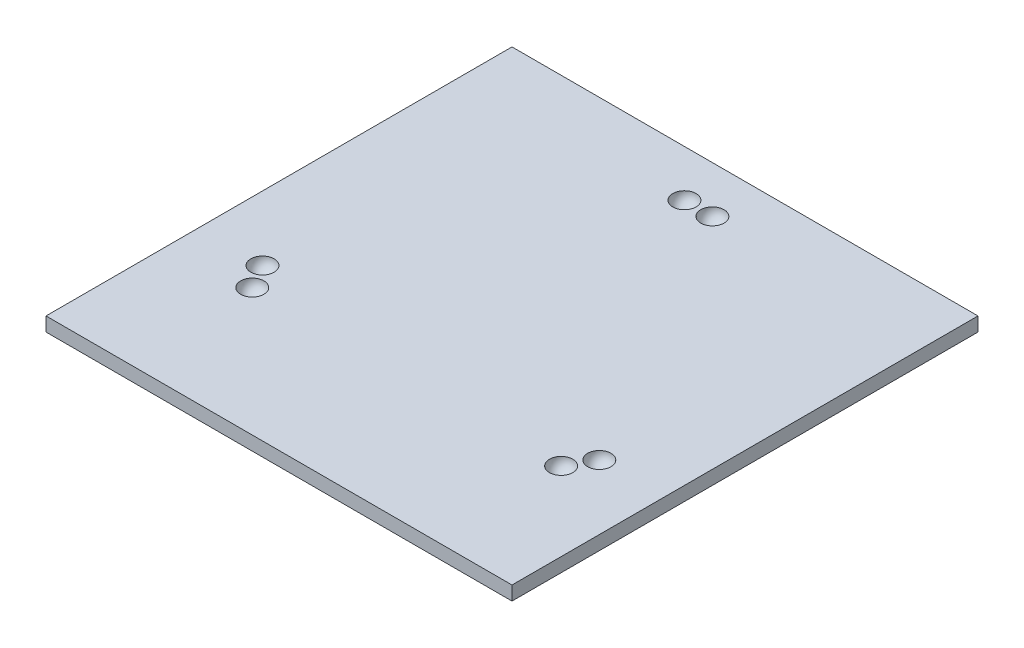
ISO-10303-21;
HEADER;
FILE_DESCRIPTION(('STEP AP214'),'2;1');
FILE_NAME('part.step','',(''),(''),'','','');
FILE_SCHEMA(('AUTOMOTIVE_DESIGN { 1 0 10303 214 1 1 1 1 }'));
ENDSEC;
DATA;
#1=APPLICATION_CONTEXT('core data for automotive mechanical design processes');
#2=APPLICATION_PROTOCOL_DEFINITION('international standard','automotive_design',2000,#1);
#3=PRODUCT_CONTEXT('',#1,'mechanical');
#4=PRODUCT('Part','Part','',(#3));
#5=PRODUCT_RELATED_PRODUCT_CATEGORY('part','',(#4));
#6=PRODUCT_DEFINITION_FORMATION('','',#4);
#7=PRODUCT_DEFINITION_CONTEXT('part definition',#1,'design');
#8=PRODUCT_DEFINITION('design','',#6,#7);
#9=PRODUCT_DEFINITION_SHAPE('','',#8);
#10=(LENGTH_UNIT() NAMED_UNIT(*) SI_UNIT(.MILLI.,.METRE.));
#11=(NAMED_UNIT(*) PLANE_ANGLE_UNIT() SI_UNIT($,.RADIAN.));
#12=(NAMED_UNIT(*) SI_UNIT($,.STERADIAN.) SOLID_ANGLE_UNIT());
#13=UNCERTAINTY_MEASURE_WITH_UNIT(LENGTH_MEASURE(1.E-05),#10,'distance_accuracy_value','');
#14=(GEOMETRIC_REPRESENTATION_CONTEXT(3) GLOBAL_UNCERTAINTY_ASSIGNED_CONTEXT((#13)) GLOBAL_UNIT_ASSIGNED_CONTEXT((#10,
#11,#12)) REPRESENTATION_CONTEXT('',''));
#15=CARTESIAN_POINT('',(0.,0.,0.));
#16=DIRECTION('',(0.,0.,1.));
#17=DIRECTION('',(1.,0.,0.));
#18=AXIS2_PLACEMENT_3D('',#15,#16,#17);
#19=CARTESIAN_POINT('',(100.,6.,100.));
#20=DIRECTION('',(-1.,0.,0.));
#21=DIRECTION('',(0.,0.,1.));
#22=AXIS2_PLACEMENT_3D('',#19,#20,#21);
#23=PLANE('',#22);
#24=DIRECTION('',(0.,0.,-1.));
#25=VECTOR('',#24,1.);
#26=CARTESIAN_POINT('',(100.,0.,100.));
#27=LINE('',#26,#25);
#28=CARTESIAN_POINT('',(100.,0.,100.));
#29=VERTEX_POINT('',#28);
#30=CARTESIAN_POINT('',(100.,0.,-100.));
#31=VERTEX_POINT('',#30);
#32=EDGE_CURVE('E95',#29,#31,#27,.T.);
#33=ORIENTED_EDGE('',*,*,#32,.T.);
#34=DIRECTION('',(0.,-1.,0.));
#35=VECTOR('',#34,1.);
#36=CARTESIAN_POINT('',(100.,6.,-100.));
#37=LINE('',#36,#35);
#38=CARTESIAN_POINT('',(100.,6.,-100.));
#39=VERTEX_POINT('',#38);
#40=EDGE_CURVE('E11',#39,#31,#37,.T.);
#41=ORIENTED_EDGE('',*,*,#40,.F.);
#42=DIRECTION('',(0.,0.,-1.));
#43=VECTOR('',#42,1.);
#44=CARTESIAN_POINT('',(100.,6.,100.));
#45=LINE('',#44,#43);
#46=CARTESIAN_POINT('',(100.,6.,100.));
#47=VERTEX_POINT('',#46);
#48=EDGE_CURVE('E83',#47,#39,#45,.T.);
#49=ORIENTED_EDGE('',*,*,#48,.F.);
#50=DIRECTION('',(0.,-1.,0.));
#51=VECTOR('',#50,1.);
#52=CARTESIAN_POINT('',(100.,6.,100.));
#53=LINE('',#52,#51);
#54=EDGE_CURVE('E91',#47,#29,#53,.T.);
#55=ORIENTED_EDGE('',*,*,#54,.T.);
#56=EDGE_LOOP('',(#33,#41,#49,#55));
#57=FACE_BOUND('',#56,.T.);
#58=ADVANCED_FACE('F32',(#57),#23,.F.);
#59=CARTESIAN_POINT('',(-100.,6.,-100.));
#60=DIRECTION('',(0.,0.,1.));
#61=DIRECTION('',(1.,0.,0.));
#62=AXIS2_PLACEMENT_3D('',#59,#60,#61);
#63=PLANE('',#62);
#64=DIRECTION('',(-1.,0.,0.));
#65=VECTOR('',#64,1.);
#66=CARTESIAN_POINT('',(-100.,0.,-100.));
#67=LINE('',#66,#65);
#68=CARTESIAN_POINT('',(-100.,0.,-100.));
#69=VERTEX_POINT('',#68);
#70=EDGE_CURVE('E87',#31,#69,#67,.T.);
#71=ORIENTED_EDGE('',*,*,#70,.T.);
#72=DIRECTION('',(0.,-1.,0.));
#73=VECTOR('',#72,1.);
#74=CARTESIAN_POINT('',(-100.,6.,-100.));
#75=LINE('',#74,#73);
#76=CARTESIAN_POINT('',(-100.,6.,-100.));
#77=VERTEX_POINT('',#76);
#78=EDGE_CURVE('E40',#77,#69,#75,.T.);
#79=ORIENTED_EDGE('',*,*,#78,.F.);
#80=DIRECTION('',(-1.,0.,0.));
#81=VECTOR('',#80,1.);
#82=CARTESIAN_POINT('',(-100.,6.,-100.));
#83=LINE('',#82,#81);
#84=EDGE_CURVE('E78',#39,#77,#83,.T.);
#85=ORIENTED_EDGE('',*,*,#84,.F.);
#86=ORIENTED_EDGE('',*,*,#40,.T.);
#87=EDGE_LOOP('',(#71,#79,#85,#86));
#88=FACE_BOUND('',#87,.T.);
#89=ADVANCED_FACE('F86',(#88),#63,.F.);
#90=CARTESIAN_POINT('',(-100.,6.,100.));
#91=DIRECTION('',(1.,0.,0.));
#92=DIRECTION('',(0.,0.,-1.));
#93=AXIS2_PLACEMENT_3D('',#90,#91,#92);
#94=PLANE('',#93);
#95=DIRECTION('',(0.,0.,1.));
#96=VECTOR('',#95,1.);
#97=CARTESIAN_POINT('',(-100.,0.,100.));
#98=LINE('',#97,#96);
#99=CARTESIAN_POINT('',(-100.,0.,100.));
#100=VERTEX_POINT('',#99);
#101=EDGE_CURVE('E65',#69,#100,#98,.T.);
#102=ORIENTED_EDGE('',*,*,#101,.T.);
#103=DIRECTION('',(0.,-1.,0.));
#104=VECTOR('',#103,1.);
#105=CARTESIAN_POINT('',(-100.,6.,100.));
#106=LINE('',#105,#104);
#107=CARTESIAN_POINT('',(-100.,6.,100.));
#108=VERTEX_POINT('',#107);
#109=EDGE_CURVE('E88',#108,#100,#106,.T.);
#110=ORIENTED_EDGE('',*,*,#109,.F.);
#111=DIRECTION('',(0.,0.,1.));
#112=VECTOR('',#111,1.);
#113=CARTESIAN_POINT('',(-100.,6.,100.));
#114=LINE('',#113,#112);
#115=EDGE_CURVE('E81',#77,#108,#114,.T.);
#116=ORIENTED_EDGE('',*,*,#115,.F.);
#117=ORIENTED_EDGE('',*,*,#78,.T.);
#118=EDGE_LOOP('',(#102,#110,#116,#117));
#119=FACE_BOUND('',#118,.T.);
#120=ADVANCED_FACE('F89',(#119),#94,.F.);
#121=CARTESIAN_POINT('',(-100.,6.,100.));
#122=DIRECTION('',(0.,0.,-1.));
#123=DIRECTION('',(-1.,0.,0.));
#124=AXIS2_PLACEMENT_3D('',#121,#122,#123);
#125=PLANE('',#124);
#126=DIRECTION('',(1.,0.,0.));
#127=VECTOR('',#126,1.);
#128=CARTESIAN_POINT('',(-100.,0.,100.));
#129=LINE('',#128,#127);
#130=EDGE_CURVE('E71',#100,#29,#129,.T.);
#131=ORIENTED_EDGE('',*,*,#130,.T.);
#132=ORIENTED_EDGE('',*,*,#54,.F.);
#133=DIRECTION('',(1.,0.,0.));
#134=VECTOR('',#133,1.);
#135=CARTESIAN_POINT('',(-100.,6.,100.));
#136=LINE('',#135,#134);
#137=EDGE_CURVE('E48',#108,#47,#136,.T.);
#138=ORIENTED_EDGE('',*,*,#137,.F.);
#139=ORIENTED_EDGE('',*,*,#109,.T.);
#140=EDGE_LOOP('',(#131,#132,#138,#139));
#141=FACE_BOUND('',#140,.T.);
#142=ADVANCED_FACE('F103',(#141),#125,.F.);
#143=CARTESIAN_POINT('',(0.,6.,0.));
#144=DIRECTION('',(0.,-1.,0.));
#145=DIRECTION('',(0.,0.,-1.));
#146=AXIS2_PLACEMENT_3D('',#143,#144,#145);
#147=PLANE('',#146);
#148=CARTESIAN_POINT('',(66.2820323027549,6.,45.196152422707));
#149=DIRECTION('',(0.,1.,0.));
#150=DIRECTION('',(0.,0.,-1.));
#151=AXIS2_PLACEMENT_3D('',#148,#149,#150);
#152=CIRCLE('',#151,5.);
#153=CARTESIAN_POINT('',(66.2820323027549,6.,40.196152422707));
#154=VERTEX_POINT('',#153);
#155=EDGE_CURVE('E123',#154,#154,#152,.T.);
#156=ORIENTED_EDGE('',*,*,#155,.F.);
#157=EDGE_LOOP('',(#156));
#158=FACE_BOUND('',#157,.T.);
#159=CARTESIAN_POINT('',(72.2820323027555,6.,34.8038475772927));
#160=DIRECTION('',(0.,-1.,0.));
#161=DIRECTION('',(-0.866025403784436,0.,0.500000000000004));
#162=AXIS2_PLACEMENT_3D('',#159,#160,#161);
#163=CIRCLE('',#162,5.);
#164=CARTESIAN_POINT('',(67.9519052838333,6.,37.3038475772927));
#165=VERTEX_POINT('',#164);
#166=EDGE_CURVE('E120',#165,#165,#163,.T.);
#167=ORIENTED_EDGE('',*,*,#166,.T.);
#168=EDGE_LOOP('',(#167));
#169=FACE_BOUND('',#168,.T.);
#170=CARTESIAN_POINT('',(6.,6.,-80.));
#171=DIRECTION('',(0.,-1.,0.));
#172=DIRECTION('',(1.,0.,0.));
#173=AXIS2_PLACEMENT_3D('',#170,#171,#172);
#174=CIRCLE('',#173,5.);
#175=CARTESIAN_POINT('',(11.,6.,-80.));
#176=VERTEX_POINT('',#175);
#177=EDGE_CURVE('E117',#176,#176,#174,.T.);
#178=ORIENTED_EDGE('',*,*,#177,.T.);
#179=EDGE_LOOP('',(#178));
#180=FACE_BOUND('',#179,.T.);
#181=CARTESIAN_POINT('',(-72.2820323027555,6.,34.8038475772927));
#182=DIRECTION('',(0.,1.,0.));
#183=DIRECTION('',(0.866025403784436,0.,0.500000000000004));
#184=AXIS2_PLACEMENT_3D('',#181,#182,#183);
#185=CIRCLE('',#184,5.);
#186=CARTESIAN_POINT('',(-67.9519052838333,6.,37.3038475772927));
#187=VERTEX_POINT('',#186);
#188=EDGE_CURVE('E114',#187,#187,#185,.T.);
#189=ORIENTED_EDGE('',*,*,#188,.F.);
#190=EDGE_LOOP('',(#189));
#191=FACE_BOUND('',#190,.T.);
#192=CARTESIAN_POINT('',(-66.2820323027549,6.,45.196152422707));
#193=DIRECTION('',(0.,-1.,0.));
#194=DIRECTION('',(0.,0.,-1.));
#195=AXIS2_PLACEMENT_3D('',#192,#193,#194);
#196=CIRCLE('',#195,5.);
#197=CARTESIAN_POINT('',(-66.2820323027549,6.,40.196152422707));
#198=VERTEX_POINT('',#197);
#199=EDGE_CURVE('E111',#198,#198,#196,.T.);
#200=ORIENTED_EDGE('',*,*,#199,.T.);
#201=EDGE_LOOP('',(#200));
#202=FACE_BOUND('',#201,.T.);
#203=CARTESIAN_POINT('',(-6.,6.,-80.));
#204=DIRECTION('',(0.,1.,0.));
#205=DIRECTION('',(-1.,0.,0.));
#206=AXIS2_PLACEMENT_3D('',#203,#204,#205);
#207=CIRCLE('',#206,5.);
#208=CARTESIAN_POINT('',(-11.,6.,-80.));
#209=VERTEX_POINT('',#208);
#210=EDGE_CURVE('E98',#209,#209,#207,.T.);
#211=ORIENTED_EDGE('',*,*,#210,.F.);
#212=EDGE_LOOP('',(#211));
#213=FACE_BOUND('',#212,.T.);
#214=ORIENTED_EDGE('',*,*,#48,.T.);
#215=ORIENTED_EDGE('',*,*,#84,.T.);
#216=ORIENTED_EDGE('',*,*,#115,.T.);
#217=ORIENTED_EDGE('',*,*,#137,.T.);
#218=EDGE_LOOP('',(#214,#215,#216,#217));
#219=FACE_BOUND('',#218,.T.);
#220=ADVANCED_FACE('F79',(#158,#169,#180,#191,#202,#213,#219),#147,.F.);
#221=CARTESIAN_POINT('',(0.,0.,0.));
#222=DIRECTION('',(0.,-1.,0.));
#223=DIRECTION('',(0.,0.,-1.));
#224=AXIS2_PLACEMENT_3D('',#221,#222,#223);
#225=PLANE('',#224);
#226=ORIENTED_EDGE('',*,*,#32,.F.);
#227=ORIENTED_EDGE('',*,*,#130,.F.);
#228=ORIENTED_EDGE('',*,*,#101,.F.);
#229=ORIENTED_EDGE('',*,*,#70,.F.);
#230=EDGE_LOOP('',(#226,#227,#228,#229));
#231=FACE_BOUND('',#230,.T.);
#232=ADVANCED_FACE('F106',(#231),#225,.T.);
#233=CARTESIAN_POINT('',(-6.,6.,-80.));
#234=DIRECTION('',(0.,1.,0.));
#235=DIRECTION('',(-1.,0.,0.));
#236=AXIS2_PLACEMENT_3D('',#233,#234,#235);
#237=SPHERICAL_SURFACE('',#236,5.);
#238=ORIENTED_EDGE('',*,*,#210,.T.);
#239=EDGE_LOOP('',(#238));
#240=FACE_BOUND('',#239,.T.);
#241=ADVANCED_FACE('F142',(#240),#237,.F.);
#242=CARTESIAN_POINT('',(-66.2820323027549,6.,45.196152422707));
#243=DIRECTION('',(0.,-1.,0.));
#244=DIRECTION('',(-0.499999999999998,0.,-0.86602540378444));
#245=AXIS2_PLACEMENT_3D('',#242,#243,#244);
#246=SPHERICAL_SURFACE('',#245,5.);
#247=ORIENTED_EDGE('',*,*,#199,.F.);
#248=EDGE_LOOP('',(#247));
#249=FACE_BOUND('',#248,.T.);
#250=ADVANCED_FACE('F144',(#249),#246,.F.);
#251=CARTESIAN_POINT('',(-72.2820323027555,6.,34.8038475772927));
#252=DIRECTION('',(0.,-1.,0.));
#253=DIRECTION('',(0.499999999999998,0.,0.86602540378444));
#254=AXIS2_PLACEMENT_3D('',#251,#252,#253);
#255=SPHERICAL_SURFACE('',#254,5.);
#256=ORIENTED_EDGE('',*,*,#188,.T.);
#257=EDGE_LOOP('',(#256));
#258=FACE_BOUND('',#257,.T.);
#259=ADVANCED_FACE('F150',(#258),#255,.F.);
#260=CARTESIAN_POINT('',(6.,6.,-80.));
#261=DIRECTION('',(0.,1.,0.));
#262=DIRECTION('',(1.,0.,0.));
#263=AXIS2_PLACEMENT_3D('',#260,#261,#262);
#264=SPHERICAL_SURFACE('',#263,5.);
#265=ORIENTED_EDGE('',*,*,#177,.F.);
#266=EDGE_LOOP('',(#265));
#267=FACE_BOUND('',#266,.T.);
#268=ADVANCED_FACE('F195',(#267),#264,.F.);
#269=CARTESIAN_POINT('',(72.2820323027555,6.,34.8038475772927));
#270=DIRECTION('',(0.,-1.,0.));
#271=DIRECTION('',(-0.499999999999998,0.,0.86602540378444));
#272=AXIS2_PLACEMENT_3D('',#269,#270,#271);
#273=SPHERICAL_SURFACE('',#272,5.);
#274=ORIENTED_EDGE('',*,*,#166,.F.);
#275=EDGE_LOOP('',(#274));
#276=FACE_BOUND('',#275,.T.);
#277=ADVANCED_FACE('F205',(#276),#273,.F.);
#278=CARTESIAN_POINT('',(66.2820323027549,6.,45.196152422707));
#279=DIRECTION('',(0.,-1.,0.));
#280=DIRECTION('',(0.499999999999998,0.,-0.86602540378444));
#281=AXIS2_PLACEMENT_3D('',#278,#279,#280);
#282=SPHERICAL_SURFACE('',#281,5.);
#283=ORIENTED_EDGE('',*,*,#155,.T.);
#284=EDGE_LOOP('',(#283));
#285=FACE_BOUND('',#284,.T.);
#286=ADVANCED_FACE('F127',(#285),#282,.F.);
#287=CLOSED_SHELL('',(#58,#89,#120,#142,#220,#232,#241,#250,#259,#268,#277,#286));
#288=MANIFOLD_SOLID_BREP('B2',#287);
#289=ADVANCED_BREP_SHAPE_REPRESENTATION('',(#18,#288),#14);
#290=SHAPE_DEFINITION_REPRESENTATION(#9,#289);
ENDSEC;
END-ISO-10303-21;
